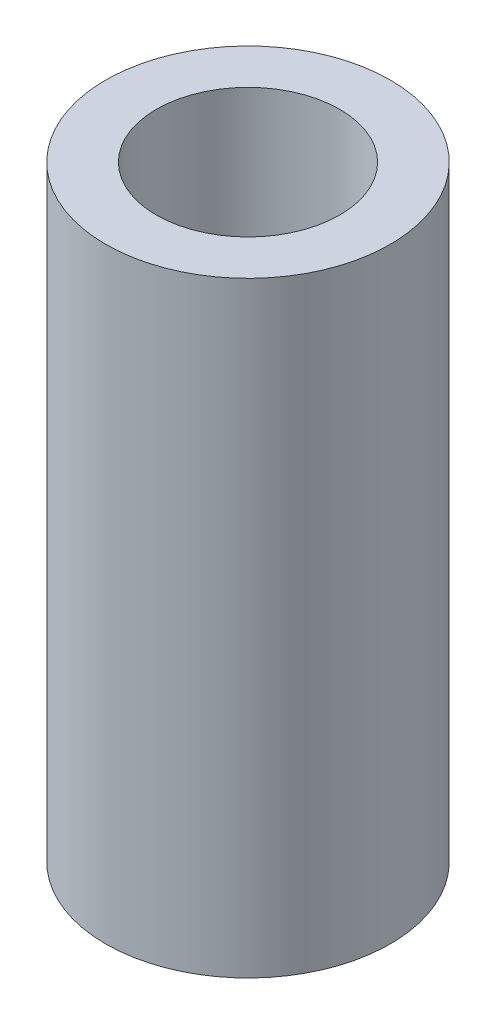
ISO-10303-21;
HEADER;
FILE_DESCRIPTION(('STEP AP214'),'2;1');
FILE_NAME('part.step','',(''),(''),'','','');
FILE_SCHEMA(('AUTOMOTIVE_DESIGN { 1 0 10303 214 1 1 1 1 }'));
ENDSEC;
DATA;
#1=APPLICATION_CONTEXT('core data for automotive mechanical design processes');
#2=APPLICATION_PROTOCOL_DEFINITION('international standard','automotive_design',2000,#1);
#3=PRODUCT_CONTEXT('',#1,'mechanical');
#4=PRODUCT('Part','Part','',(#3));
#5=PRODUCT_RELATED_PRODUCT_CATEGORY('part','',(#4));
#6=PRODUCT_DEFINITION_FORMATION('','',#4);
#7=PRODUCT_DEFINITION_CONTEXT('part definition',#1,'design');
#8=PRODUCT_DEFINITION('design','',#6,#7);
#9=PRODUCT_DEFINITION_SHAPE('','',#8);
#10=(LENGTH_UNIT() NAMED_UNIT(*) SI_UNIT(.MILLI.,.METRE.));
#11=(NAMED_UNIT(*) PLANE_ANGLE_UNIT() SI_UNIT($,.RADIAN.));
#12=(NAMED_UNIT(*) SI_UNIT($,.STERADIAN.) SOLID_ANGLE_UNIT());
#13=UNCERTAINTY_MEASURE_WITH_UNIT(LENGTH_MEASURE(1.E-05),#10,'distance_accuracy_value','');
#14=(GEOMETRIC_REPRESENTATION_CONTEXT(3) GLOBAL_UNCERTAINTY_ASSIGNED_CONTEXT((#13)) GLOBAL_UNIT_ASSIGNED_CONTEXT((#10,
#11,#12)) REPRESENTATION_CONTEXT('',''));
#15=CARTESIAN_POINT('',(0.,0.,0.));
#16=DIRECTION('',(0.,0.,1.));
#17=DIRECTION('',(1.,0.,0.));
#18=AXIS2_PLACEMENT_3D('',#15,#16,#17);
#19=CARTESIAN_POINT('',(0.,63.8672258696174,0.));
#20=DIRECTION('',(0.,-1.,0.));
#21=DIRECTION('',(0.,0.,-1.));
#22=AXIS2_PLACEMENT_3D('',#19,#20,#21);
#23=CYLINDRICAL_SURFACE('',#22,15.);
#24=CARTESIAN_POINT('',(0.,63.8672258696174,0.));
#25=DIRECTION('',(0.,1.,0.));
#26=DIRECTION('',(0.,0.,1.));
#27=AXIS2_PLACEMENT_3D('',#24,#25,#26);
#28=CIRCLE('',#27,15.);
#29=CARTESIAN_POINT('',(0.,63.8672258696174,15.));
#30=VERTEX_POINT('',#29);
#31=EDGE_CURVE('E10',#30,#30,#28,.T.);
#32=ORIENTED_EDGE('',*,*,#31,.F.);
#33=EDGE_LOOP('',(#32));
#34=FACE_BOUND('',#33,.T.);
#35=CARTESIAN_POINT('',(0.,0.,0.));
#36=DIRECTION('',(0.,1.,0.));
#37=DIRECTION('',(0.,0.,1.));
#38=AXIS2_PLACEMENT_3D('',#35,#36,#37);
#39=CIRCLE('',#38,15.);
#40=CARTESIAN_POINT('',(0.,0.,15.));
#41=VERTEX_POINT('',#40);
#42=EDGE_CURVE('E37',#41,#41,#39,.T.);
#43=ORIENTED_EDGE('',*,*,#42,.T.);
#44=EDGE_LOOP('',(#43));
#45=FACE_BOUND('',#44,.T.);
#46=ADVANCED_FACE('F40',(#34,#45),#23,.T.);
#47=CARTESIAN_POINT('',(0.,63.8672258696174,0.));
#48=DIRECTION('',(0.,1.,0.));
#49=DIRECTION('',(0.,0.,1.));
#50=AXIS2_PLACEMENT_3D('',#47,#48,#49);
#51=PLANE('',#50);
#52=CARTESIAN_POINT('',(0.,63.8672258696174,0.));
#53=DIRECTION('',(0.,1.,0.));
#54=DIRECTION('',(0.,0.,1.));
#55=AXIS2_PLACEMENT_3D('',#52,#53,#54);
#56=CIRCLE('',#55,9.66182235736957);
#57=CARTESIAN_POINT('',(0.,63.8672258696174,9.66182235736957));
#58=VERTEX_POINT('',#57);
#59=EDGE_CURVE('E50',#58,#58,#56,.T.);
#60=ORIENTED_EDGE('',*,*,#59,.F.);
#61=EDGE_LOOP('',(#60));
#62=FACE_BOUND('',#61,.T.);
#63=ORIENTED_EDGE('',*,*,#31,.T.);
#64=EDGE_LOOP('',(#63));
#65=FACE_BOUND('',#64,.T.);
#66=ADVANCED_FACE('F59',(#62,#65),#51,.T.);
#67=CARTESIAN_POINT('',(0.,0.,0.));
#68=DIRECTION('',(0.,1.,0.));
#69=DIRECTION('',(0.,0.,1.));
#70=AXIS2_PLACEMENT_3D('',#67,#68,#69);
#71=PLANE('',#70);
#72=CARTESIAN_POINT('',(0.,0.,0.));
#73=DIRECTION('',(0.,1.,0.));
#74=DIRECTION('',(0.,0.,1.));
#75=AXIS2_PLACEMENT_3D('',#72,#73,#74);
#76=CIRCLE('',#75,9.66182235736957);
#77=CARTESIAN_POINT('',(0.,0.,9.66182235736957));
#78=VERTEX_POINT('',#77);
#79=EDGE_CURVE('E47',#78,#78,#76,.T.);
#80=ORIENTED_EDGE('',*,*,#79,.T.);
#81=EDGE_LOOP('',(#80));
#82=FACE_BOUND('',#81,.T.);
#83=ORIENTED_EDGE('',*,*,#42,.F.);
#84=EDGE_LOOP('',(#83));
#85=FACE_BOUND('',#84,.T.);
#86=ADVANCED_FACE('F58',(#82,#85),#71,.F.);
#87=CARTESIAN_POINT('',(0.,63.8672258696174,0.));
#88=DIRECTION('',(0.,-1.,0.));
#89=DIRECTION('',(0.,0.,-1.));
#90=AXIS2_PLACEMENT_3D('',#87,#88,#89);
#91=CYLINDRICAL_SURFACE('',#90,9.66182235736957);
#92=ORIENTED_EDGE('',*,*,#59,.T.);
#93=EDGE_LOOP('',(#92));
#94=FACE_BOUND('',#93,.T.);
#95=ORIENTED_EDGE('',*,*,#79,.F.);
#96=EDGE_LOOP('',(#95));
#97=FACE_BOUND('',#96,.T.);
#98=ADVANCED_FACE('F54',(#94,#97),#91,.F.);
#99=CLOSED_SHELL('',(#46,#66,#86,#98));
#100=MANIFOLD_SOLID_BREP('B2',#99);
#101=ADVANCED_BREP_SHAPE_REPRESENTATION('',(#18,#100),#14);
#102=SHAPE_DEFINITION_REPRESENTATION(#9,#101);
ENDSEC;
END-ISO-10303-21;
